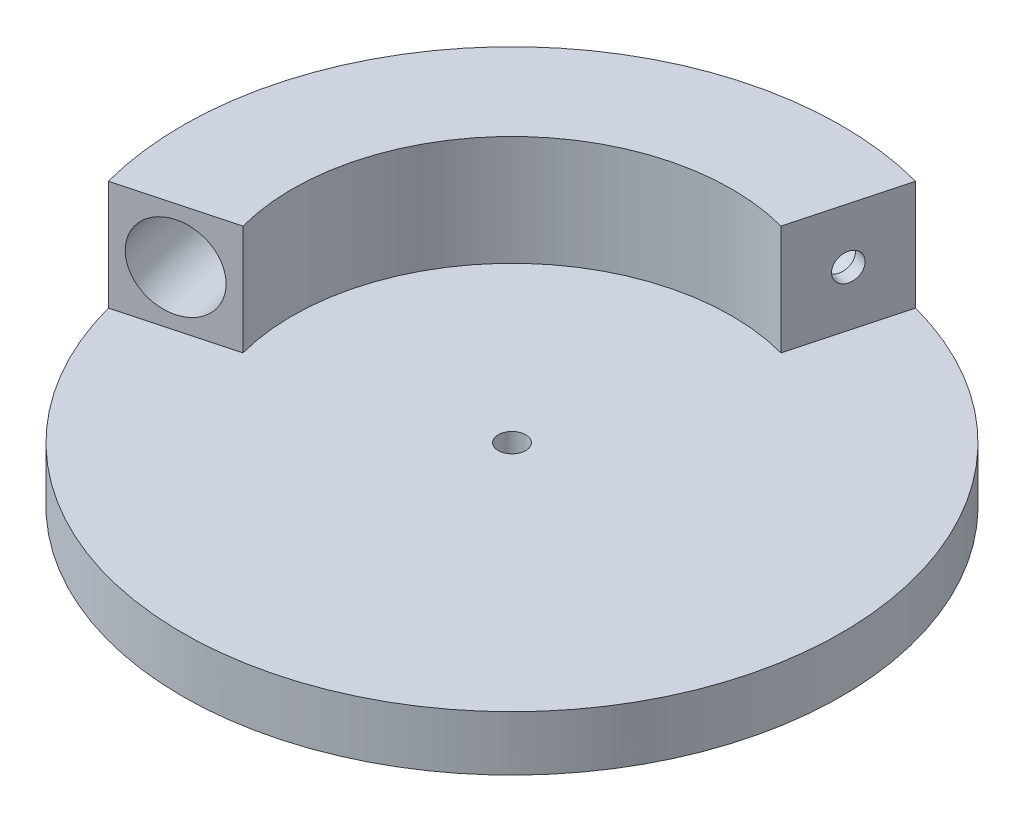
ISO-10303-21;
HEADER;
FILE_DESCRIPTION(('STEP AP214'),'2;1');
FILE_NAME('part.step','',(''),(''),'','','');
FILE_SCHEMA(('AUTOMOTIVE_DESIGN { 1 0 10303 214 1 1 1 1 }'));
ENDSEC;
DATA;
#1=APPLICATION_CONTEXT('core data for automotive mechanical design processes');
#2=APPLICATION_PROTOCOL_DEFINITION('international standard','automotive_design',2000,#1);
#3=PRODUCT_CONTEXT('',#1,'mechanical');
#4=PRODUCT('Part','Part','',(#3));
#5=PRODUCT_RELATED_PRODUCT_CATEGORY('part','',(#4));
#6=PRODUCT_DEFINITION_FORMATION('','',#4);
#7=PRODUCT_DEFINITION_CONTEXT('part definition',#1,'design');
#8=PRODUCT_DEFINITION('design','',#6,#7);
#9=PRODUCT_DEFINITION_SHAPE('','',#8);
#10=(LENGTH_UNIT() NAMED_UNIT(*) SI_UNIT(.MILLI.,.METRE.));
#11=(NAMED_UNIT(*) PLANE_ANGLE_UNIT() SI_UNIT($,.RADIAN.));
#12=(NAMED_UNIT(*) SI_UNIT($,.STERADIAN.) SOLID_ANGLE_UNIT());
#13=UNCERTAINTY_MEASURE_WITH_UNIT(LENGTH_MEASURE(1.E-05),#10,'distance_accuracy_value','');
#14=(GEOMETRIC_REPRESENTATION_CONTEXT(3) GLOBAL_UNCERTAINTY_ASSIGNED_CONTEXT((#13)) GLOBAL_UNIT_ASSIGNED_CONTEXT((#10,
#11,#12)) REPRESENTATION_CONTEXT('',''));
#15=CARTESIAN_POINT('',(0.,0.,0.));
#16=DIRECTION('',(0.,0.,1.));
#17=DIRECTION('',(1.,0.,0.));
#18=AXIS2_PLACEMENT_3D('',#15,#16,#17);
#19=CARTESIAN_POINT('',(0.,6.35,0.));
#20=DIRECTION('',(0.,-1.,0.));
#21=DIRECTION('',(0.,0.,-1.));
#22=AXIS2_PLACEMENT_3D('',#19,#20,#21);
#23=CYLINDRICAL_SURFACE('',#22,38.1);
#24=CARTESIAN_POINT('',(0.,6.35,0.));
#25=DIRECTION('',(0.,1.,0.));
#26=DIRECTION('',(0.,0.,1.));
#27=AXIS2_PLACEMENT_3D('',#24,#25,#26);
#28=CIRCLE('',#27,38.1);
#29=CARTESIAN_POINT('',(-36.8017739816136,6.35,9.86100561840581));
#30=VERTEX_POINT('',#29);
#31=CARTESIAN_POINT('',(9.86100561840607,6.35,-36.8017739816135));
#32=VERTEX_POINT('',#31);
#33=EDGE_CURVE('E11',#30,#32,#28,.T.);
#34=ORIENTED_EDGE('',*,*,#33,.F.);
#35=DIRECTION('',(0.,-1.,0.));
#36=VECTOR('',#35,1.);
#37=CARTESIAN_POINT('',(-36.8017739816136,19.05,9.86100561840581));
#38=LINE('',#37,#36);
#39=CARTESIAN_POINT('',(-36.8017739816136,19.05,9.86100561840581));
#40=VERTEX_POINT('',#39);
#41=EDGE_CURVE('E111',#40,#30,#38,.T.);
#42=ORIENTED_EDGE('',*,*,#41,.F.);
#43=CARTESIAN_POINT('',(0.,19.05,0.));
#44=DIRECTION('',(0.,1.,0.));
#45=DIRECTION('',(0.,0.,1.));
#46=AXIS2_PLACEMENT_3D('',#43,#44,#45);
#47=CIRCLE('',#46,38.1);
#48=CARTESIAN_POINT('',(9.86100561840607,19.05,-36.8017739816135));
#49=VERTEX_POINT('',#48);
#50=EDGE_CURVE('E86',#49,#40,#47,.T.);
#51=ORIENTED_EDGE('',*,*,#50,.F.);
#52=DIRECTION('',(0.,-1.,0.));
#53=VECTOR('',#52,1.);
#54=CARTESIAN_POINT('',(9.86100561840607,19.05,-36.8017739816135));
#55=LINE('',#54,#53);
#56=EDGE_CURVE('E78',#49,#32,#55,.T.);
#57=ORIENTED_EDGE('',*,*,#56,.T.);
#58=EDGE_LOOP('',(#34,#42,#51,#57));
#59=FACE_BOUND('',#58,.T.);
#60=CARTESIAN_POINT('',(0.,0.,0.));
#61=DIRECTION('',(0.,1.,0.));
#62=DIRECTION('',(0.,0.,1.));
#63=AXIS2_PLACEMENT_3D('',#60,#61,#62);
#64=CIRCLE('',#63,38.1);
#65=CARTESIAN_POINT('',(0.,0.,38.1));
#66=VERTEX_POINT('',#65);
#67=EDGE_CURVE('E38',#66,#66,#64,.T.);
#68=ORIENTED_EDGE('',*,*,#67,.T.);
#69=EDGE_LOOP('',(#68));
#70=FACE_BOUND('',#69,.T.);
#71=ADVANCED_FACE('F35',(#59,#70),#23,.T.);
#72=CARTESIAN_POINT('',(0.,6.35,0.));
#73=DIRECTION('',(0.,1.,0.));
#74=DIRECTION('',(0.,0.,1.));
#75=AXIS2_PLACEMENT_3D('',#72,#73,#74);
#76=PLANE('',#75);
#77=CARTESIAN_POINT('',(0.,6.35,0.));
#78=DIRECTION('',(0.,1.,0.));
#79=DIRECTION('',(0.,0.,1.));
#80=AXIS2_PLACEMENT_3D('',#77,#78,#79);
#81=CIRCLE('',#80,1.5875);
#82=CARTESIAN_POINT('',(0.,6.35,1.5875));
#83=VERTEX_POINT('',#82);
#84=EDGE_CURVE('E161',#83,#83,#81,.T.);
#85=ORIENTED_EDGE('',*,*,#84,.F.);
#86=EDGE_LOOP('',(#85));
#87=FACE_BOUND('',#86,.T.);
#88=DIRECTION('',(0.96592582628907,0.,-0.258819045102515));
#89=VECTOR('',#88,1.);
#90=CARTESIAN_POINT('',(0.,6.35,0.));
#91=LINE('',#90,#89);
#92=CARTESIAN_POINT('',(-24.5345159877424,6.35,6.57400374560387));
#93=VERTEX_POINT('',#92);
#94=EDGE_CURVE('E92',#30,#93,#91,.T.);
#95=ORIENTED_EDGE('',*,*,#94,.F.);
#96=ORIENTED_EDGE('',*,*,#33,.T.);
#97=DIRECTION('',(0.258819045102521,0.,-0.965925826289068));
#98=VECTOR('',#97,1.);
#99=CARTESIAN_POINT('',(0.,6.35,0.));
#100=LINE('',#99,#98);
#101=CARTESIAN_POINT('',(6.57400374560404,6.35,-24.5345159877423));
#102=VERTEX_POINT('',#101);
#103=EDGE_CURVE('E53',#102,#32,#100,.T.);
#104=ORIENTED_EDGE('',*,*,#103,.F.);
#105=CARTESIAN_POINT('',(0.,6.35,0.));
#106=DIRECTION('',(0.,1.,0.));
#107=DIRECTION('',(0.,0.,1.));
#108=AXIS2_PLACEMENT_3D('',#105,#106,#107);
#109=CIRCLE('',#108,25.4);
#110=EDGE_CURVE('E49',#102,#93,#109,.T.);
#111=ORIENTED_EDGE('',*,*,#110,.T.);
#112=EDGE_LOOP('',(#95,#96,#104,#111));
#113=FACE_BOUND('',#112,.T.);
#114=ADVANCED_FACE('F120',(#87,#113),#76,.T.);
#115=CARTESIAN_POINT('',(0.,0.,0.));
#116=DIRECTION('',(0.,1.,0.));
#117=DIRECTION('',(0.,0.,1.));
#118=AXIS2_PLACEMENT_3D('',#115,#116,#117);
#119=PLANE('',#118);
#120=CARTESIAN_POINT('',(0.,0.,0.));
#121=DIRECTION('',(0.,1.,0.));
#122=DIRECTION('',(0.,0.,1.));
#123=AXIS2_PLACEMENT_3D('',#120,#121,#122);
#124=CIRCLE('',#123,1.5875);
#125=CARTESIAN_POINT('',(0.,0.,1.5875));
#126=VERTEX_POINT('',#125);
#127=EDGE_CURVE('E164',#126,#126,#124,.F.);
#128=ORIENTED_EDGE('',*,*,#127,.F.);
#129=EDGE_LOOP('',(#128));
#130=FACE_BOUND('',#129,.T.);
#131=ORIENTED_EDGE('',*,*,#67,.F.);
#132=EDGE_LOOP('',(#131));
#133=FACE_BOUND('',#132,.T.);
#134=ADVANCED_FACE('F122',(#130,#133),#119,.F.);
#135=CARTESIAN_POINT('',(0.,19.05,0.));
#136=DIRECTION('',(0.,-1.,0.));
#137=DIRECTION('',(0.,0.,-1.));
#138=AXIS2_PLACEMENT_3D('',#135,#136,#137);
#139=CYLINDRICAL_SURFACE('',#138,25.4);
#140=ORIENTED_EDGE('',*,*,#110,.F.);
#141=DIRECTION('',(0.,-1.,0.));
#142=VECTOR('',#141,1.);
#143=CARTESIAN_POINT('',(6.57400374560404,19.05,-24.5345159877423));
#144=LINE('',#143,#142);
#145=CARTESIAN_POINT('',(6.57400374560404,19.05,-24.5345159877423));
#146=VERTEX_POINT('',#145);
#147=EDGE_CURVE('E72',#146,#102,#144,.T.);
#148=ORIENTED_EDGE('',*,*,#147,.F.);
#149=CARTESIAN_POINT('',(0.,19.05,0.));
#150=DIRECTION('',(0.,1.,0.));
#151=DIRECTION('',(0.,0.,1.));
#152=AXIS2_PLACEMENT_3D('',#149,#150,#151);
#153=CIRCLE('',#152,25.4);
#154=CARTESIAN_POINT('',(-24.5345159877424,19.05,6.57400374560387));
#155=VERTEX_POINT('',#154);
#156=EDGE_CURVE('E76',#146,#155,#153,.T.);
#157=ORIENTED_EDGE('',*,*,#156,.T.);
#158=DIRECTION('',(0.,-1.,0.));
#159=VECTOR('',#158,1.);
#160=CARTESIAN_POINT('',(-24.5345159877424,19.05,6.57400374560387));
#161=LINE('',#160,#159);
#162=EDGE_CURVE('E107',#155,#93,#161,.T.);
#163=ORIENTED_EDGE('',*,*,#162,.T.);
#164=EDGE_LOOP('',(#140,#148,#157,#163));
#165=FACE_BOUND('',#164,.T.);
#166=ADVANCED_FACE('F74',(#165),#139,.F.);
#167=CARTESIAN_POINT('',(0.,19.05,0.));
#168=DIRECTION('',(-0.965925826289068,0.,-0.258819045102521));
#169=DIRECTION('',(-0.258819045102521,0.,0.965925826289068));
#170=AXIS2_PLACEMENT_3D('',#167,#168,#169);
#171=PLANE('',#170);
#172=CARTESIAN_POINT('',(8.21750468200505,12.7,-30.6681449846779));
#173=DIRECTION('',(0.965925826289068,0.,0.258819045102521));
#174=DIRECTION('',(0.258819045102521,0.,-0.965925826289068));
#175=AXIS2_PLACEMENT_3D('',#172,#173,#174);
#176=CIRCLE('',#175,1.5875);
#177=CARTESIAN_POINT('',(8.6283799161053,12.7,-32.2015522339118));
#178=VERTEX_POINT('',#177);
#179=EDGE_CURVE('E165',#178,#178,#176,.T.);
#180=ORIENTED_EDGE('',*,*,#179,.F.);
#181=EDGE_LOOP('',(#180));
#182=FACE_BOUND('',#181,.T.);
#183=ORIENTED_EDGE('',*,*,#103,.T.);
#184=ORIENTED_EDGE('',*,*,#56,.F.);
#185=DIRECTION('',(0.258819045102521,0.,-0.965925826289068));
#186=VECTOR('',#185,1.);
#187=CARTESIAN_POINT('',(0.,19.05,0.));
#188=LINE('',#187,#186);
#189=EDGE_CURVE('E81',#146,#49,#188,.T.);
#190=ORIENTED_EDGE('',*,*,#189,.F.);
#191=ORIENTED_EDGE('',*,*,#147,.T.);
#192=EDGE_LOOP('',(#183,#184,#190,#191));
#193=FACE_BOUND('',#192,.T.);
#194=ADVANCED_FACE('F82',(#182,#193),#171,.F.);
#195=CARTESIAN_POINT('',(0.,19.05,0.));
#196=DIRECTION('',(-0.258819045102515,0.,-0.96592582628907));
#197=DIRECTION('',(-0.96592582628907,0.,0.258819045102515));
#198=AXIS2_PLACEMENT_3D('',#195,#196,#197);
#199=PLANE('',#198);
#200=CARTESIAN_POINT('',(-30.668144984678,12.7,8.21750468200484));
#201=DIRECTION('',(0.258819045102515,0.,0.96592582628907));
#202=DIRECTION('',(0.96592582628907,0.,-0.258819045102515));
#203=AXIS2_PLACEMENT_3D('',#200,#201,#202);
#204=CIRCLE('',#203,4.7625);
#205=CARTESIAN_POINT('',(-26.0679232369763,12.7,6.98487897970411));
#206=VERTEX_POINT('',#205);
#207=EDGE_CURVE('E173',#206,#206,#204,.T.);
#208=ORIENTED_EDGE('',*,*,#207,.F.);
#209=EDGE_LOOP('',(#208));
#210=FACE_BOUND('',#209,.T.);
#211=ORIENTED_EDGE('',*,*,#94,.T.);
#212=ORIENTED_EDGE('',*,*,#162,.F.);
#213=DIRECTION('',(0.96592582628907,0.,-0.258819045102515));
#214=VECTOR('',#213,1.);
#215=CARTESIAN_POINT('',(0.,19.05,0.));
#216=LINE('',#215,#214);
#217=EDGE_CURVE('E90',#40,#155,#216,.T.);
#218=ORIENTED_EDGE('',*,*,#217,.F.);
#219=ORIENTED_EDGE('',*,*,#41,.T.);
#220=EDGE_LOOP('',(#211,#212,#218,#219));
#221=FACE_BOUND('',#220,.T.);
#222=ADVANCED_FACE('F119',(#210,#221),#199,.F.);
#223=CARTESIAN_POINT('',(0.,19.05,0.));
#224=DIRECTION('',(0.,1.,0.));
#225=DIRECTION('',(0.,0.,1.));
#226=AXIS2_PLACEMENT_3D('',#223,#224,#225);
#227=PLANE('',#226);
#228=ORIENTED_EDGE('',*,*,#156,.F.);
#229=ORIENTED_EDGE('',*,*,#189,.T.);
#230=ORIENTED_EDGE('',*,*,#50,.T.);
#231=ORIENTED_EDGE('',*,*,#217,.T.);
#232=EDGE_LOOP('',(#228,#229,#230,#231));
#233=FACE_BOUND('',#232,.T.);
#234=ADVANCED_FACE('F88',(#233),#227,.T.);
#235=CARTESIAN_POINT('',(0.,12.7,0.));
#236=DIRECTION('',(0.,1.,0.));
#237=DIRECTION('',(0.,0.,1.));
#238=AXIS2_PLACEMENT_3D('',#235,#236,#237);
#239=TOROIDAL_SURFACE('',#238,31.75,4.7625);
#240=CARTESIAN_POINT('',(7.58197526175992,9.4755423628727,-34.4299458955539));
#241=CARTESIAN_POINT('',(7.60542726869876,9.57393322929301,-34.5174699769891));
#242=CARTESIAN_POINT('',(7.62780313400054,9.67613139450511,-34.6009778431586));
#243=CARTESIAN_POINT('',(7.670256849423,9.88747387051592,-34.7594172660853));
#244=CARTESIAN_POINT('',(7.69033409924756,9.99661998428228,-34.8343465825068));
#245=CARTESIAN_POINT('',(7.72805530358064,10.2211529299372,-34.9751240336006));
#246=CARTESIAN_POINT('',(7.74569709575398,10.3365451825795,-35.0409640983281));
#247=CARTESIAN_POINT('',(7.77840694608954,10.5727075255805,-35.1630389216883));
#248=CARTESIAN_POINT('',(7.79347406172335,10.6934795650428,-35.2192701627572));
#249=CARTESIAN_POINT('',(7.82090759948644,10.9394021940554,-35.3216535195204));
#250=CARTESIAN_POINT('',(7.83327620823235,11.0645491424592,-35.3678137957791));
#251=CARTESIAN_POINT('',(7.85524400732912,11.3184719650315,-35.4497987381387));
#252=CARTESIAN_POINT('',(7.86484217478301,11.4472491603391,-35.4856195867362));
#253=CARTESIAN_POINT('',(7.88118927362919,11.7073913629669,-35.5466277901865));
#254=CARTESIAN_POINT('',(7.88793995652837,11.8387547273106,-35.571821681752));
#255=CARTESIAN_POINT('',(7.89855435339819,12.1032610032778,-35.6114351501619));
#256=CARTESIAN_POINT('',(7.90241700127801,12.2364045535979,-35.6258507483011));
#257=CARTESIAN_POINT('',(7.90722187429707,12.5033798746008,-35.6437827785322));
#258=CARTESIAN_POINT('',(7.90816619298086,12.6372110829034,-35.6473070238386));
#259=CARTESIAN_POINT('',(7.9071333899316,12.9047546151245,-35.6434525503846));
#260=CARTESIAN_POINT('',(7.90515518962814,13.03846687692,-35.6360698063445));
#261=CARTESIAN_POINT('',(7.89829065372477,13.3047274481827,-35.6104510095827));
#262=CARTESIAN_POINT('',(7.89340528380744,13.4372761293303,-35.5922185608375));
#263=CARTESIAN_POINT('',(7.88075980316744,13.7003608885462,-35.5450249846029));
#264=CARTESIAN_POINT('',(7.87299863164315,13.8308962054107,-35.516059898148));
#265=CARTESIAN_POINT('',(7.85466185312776,14.0889090700759,-35.4476261090814));
#266=CARTESIAN_POINT('',(7.84408771532772,14.2163881763319,-35.4081628895654));
#267=CARTESIAN_POINT('',(7.82019483523919,14.4674979706908,-35.3189934471359));
#268=CARTESIAN_POINT('',(7.80687508153087,14.591127221225,-35.2692834495521));
#269=CARTESIAN_POINT('',(7.7775915338356,14.8335738713034,-35.1599957617275));
#270=CARTESIAN_POINT('',(7.76162872113425,14.9523930363837,-35.1004217336944));
#271=CARTESIAN_POINT('',(7.72717178079491,15.1844353907096,-34.9718266816746));
#272=CARTESIAN_POINT('',(7.70867672038655,15.2976564968569,-34.9028021765415));
#273=CARTESIAN_POINT('',(7.6495762397846,15.6276892449337,-34.6822361801833));
#274=CARTESIAN_POINT('',(7.60533578080039,15.8350333606029,-34.5171285395041));
#275=CARTESIAN_POINT('',(7.50850294115222,16.2179934504778,-34.1557434620959));
#276=CARTESIAN_POINT('',(7.45591054319116,16.3936093589719,-33.9594659608134));
#277=CARTESIAN_POINT('',(7.34379648923842,16.7084528202406,-33.5410506152192));
#278=CARTESIAN_POINT('',(7.28426901021009,16.8476494706828,-33.318891039039));
#279=CARTESIAN_POINT('',(7.16001699805675,17.0854920607167,-32.8551762167401));
#280=CARTESIAN_POINT('',(7.09529243039578,17.1841377308103,-32.6136208417314));
#281=CARTESIAN_POINT('',(6.96240959150862,17.3381977236367,-32.1176953355506));
#282=CARTESIAN_POINT('',(6.89424780344626,17.3935667711484,-31.8633120793671));
#283=CARTESIAN_POINT('',(6.75648632779052,17.45934709514,-31.3491792528942));
#284=CARTESIAN_POINT('',(6.68688663270726,17.4697581373801,-31.0894296546522));
#285=CARTESIAN_POINT('',(6.54816003506237,17.4453277066205,-30.5716949438803));
#286=CARTESIAN_POINT('',(6.47903359984144,17.4104466022939,-30.3137115754896));
#287=CARTESIAN_POINT('',(6.34327624467748,17.2963535324473,-29.8070582285166));
#288=CARTESIAN_POINT('',(6.27664533284557,17.217141422853,-29.5583882802052));
#289=CARTESIAN_POINT('',(6.14775244100391,17.0165967323843,-29.0773534591177));
#290=CARTESIAN_POINT('',(6.08549167802409,16.8952524737596,-28.844993128359));
#291=CARTESIAN_POINT('',(5.96713066242328,16.613876636469,-28.4032638045013));
#292=CARTESIAN_POINT('',(5.91103039814439,16.4538451310153,-28.1938947678945));
#293=CARTESIAN_POINT('',(5.80662273445142,16.0997317327364,-27.8042400622927));
#294=CARTESIAN_POINT('',(5.75831054220257,15.9056709365006,-27.623936506195));
#295=CARTESIAN_POINT('',(5.67081840141733,15.4889273076009,-27.2974113915215));
#296=CARTESIAN_POINT('',(5.63163838668618,15.2662446824211,-27.1511895859036));
#297=CARTESIAN_POINT('',(5.56358242814373,14.7989090115486,-26.8972012908653));
#298=CARTESIAN_POINT('',(5.53469215962854,14.5542871072638,-26.7893813409223));
#299=CARTESIAN_POINT('',(5.4879693455884,14.0497566141397,-26.6150094250519));
#300=CARTESIAN_POINT('',(5.47013669557778,13.7898481697713,-26.5484570691787));
#301=CARTESIAN_POINT('',(5.44606072019903,13.262542857804,-26.4586043058234));
#302=CARTESIAN_POINT('',(5.43979997719612,12.9951578605196,-26.4352388948435));
#303=CARTESIAN_POINT('',(5.43899500317333,12.460124928228,-26.4322346908916));
#304=CARTESIAN_POINT('',(5.44445071276845,12.1924769945604,-26.452595676292));
#305=CARTESIAN_POINT('',(5.46691288637907,11.6647136756411,-26.5364256494552));
#306=CARTESIAN_POINT('',(5.48391126122036,11.4045931481507,-26.599864448009));
#307=CARTESIAN_POINT('',(5.52896542152345,10.8990550112174,-26.7680088633525));
#308=CARTESIAN_POINT('',(5.55702121585849,10.6536374135734,-26.8727145132576));
#309=CARTESIAN_POINT('',(5.6233964079796,10.1843413317145,-27.1204301026157));
#310=CARTESIAN_POINT('',(5.66172166685639,9.9604752470793,-27.2634619159571));
#311=CARTESIAN_POINT('',(5.74757364715313,9.54065045949576,-27.583865868355));
#312=CARTESIAN_POINT('',(5.79510045396984,9.34469201557893,-27.7612383261164));
#313=CARTESIAN_POINT('',(5.87223609341976,9.07590398582403,-28.0491124516178));
#314=CARTESIAN_POINT('',(5.89895958970561,8.99040776817364,-28.1488458975125));
#315=CARTESIAN_POINT('',(5.95417011644433,8.82840933694041,-28.3548943884141));
#316=CARTESIAN_POINT('',(5.98265649671739,8.75190383726199,-28.4612070069168));
#317=CARTESIAN_POINT('',(6.04120291005575,8.60840053137153,-28.6797051960965));
#318=CARTESIAN_POINT('',(6.07126353132942,8.54140631420944,-28.7918929619969));
#319=CARTESIAN_POINT('',(6.13272575025901,8.41744480931496,-29.0212730857881));
#320=CARTESIAN_POINT('',(6.16412685143131,8.36047384855258,-29.1384635907767));
#321=CARTESIAN_POINT('',(6.2281160943859,8.25683738153098,-29.3772746966211));
#322=CARTESIAN_POINT('',(6.26070631231173,8.21019101351039,-29.4989030457501));
#323=CARTESIAN_POINT('',(6.32677542512077,8.12768160362306,-29.7454763315644));
#324=CARTESIAN_POINT('',(6.36025398906213,8.09181460575432,-29.870420033158));
#325=CARTESIAN_POINT('',(6.42788492659731,8.03108446390084,-30.1228221282028));
#326=CARTESIAN_POINT('',(6.46203752131572,8.00622499593561,-30.2502813469022));
#327=CARTESIAN_POINT('',(6.53075045087227,7.96771072957798,-30.5067214911442));
#328=CARTESIAN_POINT('',(6.56531063074365,7.95405180365475,-30.6357018383429));
#329=CARTESIAN_POINT('',(6.6346401776484,7.93801263111389,-30.8944432298571));
#330=CARTESIAN_POINT('',(6.66940971759649,7.93564353904059,-31.0242049194992));
#331=CARTESIAN_POINT('',(6.73886400613966,7.94223086989737,-31.2834118531459));
#332=CARTESIAN_POINT('',(6.77354878127058,7.9511831174651,-31.4128571961836));
#333=CARTESIAN_POINT('',(6.84262130760295,7.98035291379089,-31.6706393738631));
#334=CARTESIAN_POINT('',(6.87700886178763,8.00057742800705,-31.7989754732283));
#335=CARTESIAN_POINT('',(6.94520769138783,8.05214506707616,-32.053496970313));
#336=CARTESIAN_POINT('',(6.97901917499702,8.08348408177918,-32.1796831450218));
#337=CARTESIAN_POINT('',(7.04586040875664,8.15708590123414,-32.4291380254533));
#338=CARTESIAN_POINT('',(7.07888962591284,8.19935593260922,-32.5524047420144));
#339=CARTESIAN_POINT('',(7.14389536923902,8.29449309708036,-32.7950094788915));
#340=CARTESIAN_POINT('',(7.17587227685418,8.34735633993244,-32.9143489227803));
#341=CARTESIAN_POINT('',(7.23853051302,8.46326565539972,-33.1481926436637));
#342=CARTESIAN_POINT('',(7.26921297244902,8.52630259735362,-33.262701141154));
#343=CARTESIAN_POINT('',(7.32908383997795,8.66212176984068,-33.4861422606652));
#344=CARTESIAN_POINT('',(7.35827263941871,8.7349014295117,-33.5950763431901));
#345=CARTESIAN_POINT('',(7.42207462674149,8.90914808433662,-33.8331886015025));
#346=CARTESIAN_POINT('',(7.45621197834469,9.01323173955099,-33.9605909321216));
#347=CARTESIAN_POINT('',(7.52145556793992,9.23472807752444,-34.2040833233591));
#348=CARTESIAN_POINT('',(7.55256180674151,9.35214075672344,-34.320173386999));
#349=CARTESIAN_POINT('',(7.58197526175992,9.4755423628727,-34.4299458955539));
#350=B_SPLINE_CURVE_WITH_KNOTS('',3,(#240,#241,#242,#243,#244,#245,#246,#247,#248,#249,#250,
#251,#252,#253,#254,#255,#256,#257,#258,#259,#260,#261,#262,#263,#264,#265,#266,#267,#268,#269,
#270,#271,#272,#273,#274,#275,#276,#277,#278,#279,#280,#281,#282,#283,#284,#285,#286,#287,#288,
#289,#290,#291,#292,#293,#294,#295,#296,#297,#298,#299,#300,#301,#302,#303,#304,#305,#306,#307,
#308,#309,#310,#311,#312,#313,#314,#315,#316,#317,#318,#319,#320,#321,#322,#323,#324,#325,#326,
#327,#328,#329,#330,#331,#332,#333,#334,#335,#336,#337,#338,#339,#340,#341,#342,#343,#344,#345,
#346,#347,#348,#349),.UNSPECIFIED.,.T.,.F.,(4,2,2,2,2,2,2,2,2,2,2,2,2,2,2,2,2,2,2,2,2,2,2,2,2,2,
2,2,2,2,2,2,2,2,2,2,2,2,2,2,2,2,2,2,2,2,2,2,2,2,2,2,2,2,4),(0.,0.401127929093871,
0.802360377148689,1.20394680163356,1.60567992395778,2.00708630039203,2.40864069428394,
2.80994772790205,3.21140282717775,3.6125698645501,4.01388499163585,4.41506688711718,
4.81639691477673,5.21751774093269,5.61878659541039,6.01990680392732,6.42117516727951,
7.22317869279819,8.02518387931017,8.82786738933605,9.63055623383736,10.4340837170555,
11.2376153868028,12.0418506331885,12.8460884933254,13.6505494419166,14.4550088681506,
15.2589713186174,16.0629279413654,16.8657609335072,17.6685863394028,18.4702023730936,
19.2718143437916,20.0728651186415,20.8739165363109,21.6754261153802,22.476943133371,
22.8787155381651,23.2803406359212,23.6821168850025,24.083745594809,24.4861126643926,
24.8883318854325,25.2906853284658,25.6928904328287,26.0954928402756,26.4979468093868,
26.9006497425487,27.3032039109031,27.7060248959499,28.108698219498,28.5110121423258,
28.91322011296,29.4163140051418,29.9194077629511),.UNSPECIFIED.);
#351=CARTESIAN_POINT('',(7.58197526175992,9.4755423628727,-34.4299458955539));
#352=VERTEX_POINT('',#351);
#353=EDGE_CURVE('E97',#352,#352,#350,.T.);
#354=ORIENTED_EDGE('',*,*,#353,.T.);
#355=EDGE_LOOP('',(#354));
#356=FACE_BOUND('',#355,.T.);
#357=ORIENTED_EDGE('',*,*,#207,.T.);
#358=EDGE_LOOP('',(#357));
#359=FACE_BOUND('',#358,.T.);
#360=ADVANCED_FACE('F141',(#356,#359),#239,.F.);
#361=CARTESIAN_POINT('',(-1.5334072492339,19.05,-0.410875234100253));
#362=DIRECTION('',(-0.965925826289068,0.,-0.258819045102521));
#363=DIRECTION('',(-0.258819045102521,0.,0.965925826289068));
#364=AXIS2_PLACEMENT_3D('',#361,#362,#363);
#365=PLANE('',#364);
#366=CARTESIAN_POINT('',(6.68409743277116,12.7,-31.0790202187782));
#367=DIRECTION('',(-0.965925826289068,0.,-0.258819045102521));
#368=DIRECTION('',(-0.258819045102521,0.,0.965925826289068));
#369=AXIS2_PLACEMENT_3D('',#366,#367,#368);
#370=CIRCLE('',#369,1.5875);
#371=CARTESIAN_POINT('',(6.27322219867091,12.7,-29.5456129695443));
#372=VERTEX_POINT('',#371);
#373=EDGE_CURVE('E168',#372,#372,#370,.F.);
#374=ORIENTED_EDGE('',*,*,#373,.T.);
#375=EDGE_LOOP('',(#374));
#376=FACE_BOUND('',#375,.T.);
#377=ORIENTED_EDGE('',*,*,#353,.F.);
#378=EDGE_LOOP('',(#377));
#379=FACE_BOUND('',#378,.T.);
#380=ADVANCED_FACE('F142',(#376,#379),#365,.T.);
#381=CARTESIAN_POINT('',(-36.8564622727904,12.7,-42.7456780298825));
#382=DIRECTION('',(0.965925826289068,0.,0.258819045102521));
#383=DIRECTION('',(0.258819045102521,0.,-0.965925826289068));
#384=AXIS2_PLACEMENT_3D('',#381,#382,#383);
#385=CYLINDRICAL_SURFACE('',#384,1.5875);
#386=ORIENTED_EDGE('',*,*,#373,.F.);
#387=EDGE_LOOP('',(#386));
#388=FACE_BOUND('',#387,.T.);
#389=ORIENTED_EDGE('',*,*,#179,.T.);
#390=EDGE_LOOP('',(#389));
#391=FACE_BOUND('',#390,.T.);
#392=ADVANCED_FACE('F145',(#388,#391),#385,.F.);
#393=CARTESIAN_POINT('',(0.,-0.00100000000000013,0.));
#394=DIRECTION('',(0.,1.,0.));
#395=DIRECTION('',(0.,0.,1.));
#396=AXIS2_PLACEMENT_3D('',#393,#394,#395);
#397=CYLINDRICAL_SURFACE('',#396,1.5875);
#398=ORIENTED_EDGE('',*,*,#84,.T.);
#399=EDGE_LOOP('',(#398));
#400=FACE_BOUND('',#399,.T.);
#401=ORIENTED_EDGE('',*,*,#127,.T.);
#402=EDGE_LOOP('',(#401));
#403=FACE_BOUND('',#402,.T.);
#404=ADVANCED_FACE('F153',(#400,#403),#397,.F.);
#405=CLOSED_SHELL('',(#71,#114,#134,#166,#194,#222,#234,#360,#380,#392,#404));
#406=MANIFOLD_SOLID_BREP('B2',#405);
#407=ADVANCED_BREP_SHAPE_REPRESENTATION('',(#18,#406),#14);
#408=SHAPE_DEFINITION_REPRESENTATION(#9,#407);
ENDSEC;
END-ISO-10303-21;
